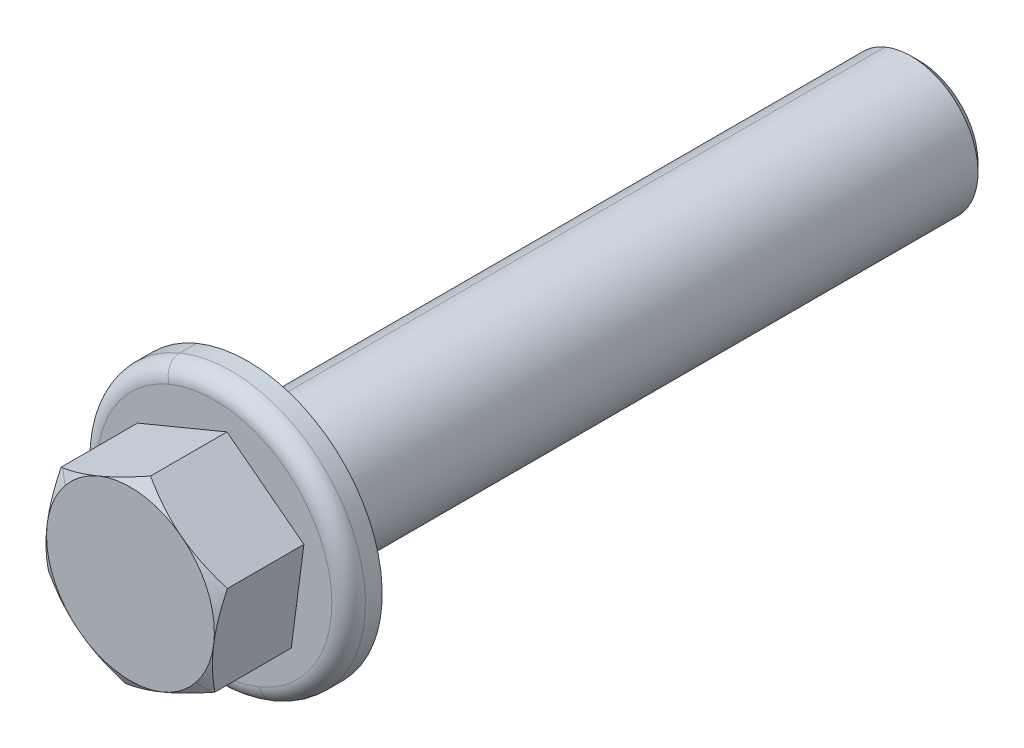
ISO-10303-21;
HEADER;
FILE_DESCRIPTION(('STEP AP214'),'2;1');
FILE_NAME('part.step','',(''),(''),'','','');
FILE_SCHEMA(('AUTOMOTIVE_DESIGN { 1 0 10303 214 1 1 1 1 }'));
ENDSEC;
DATA;
#1=APPLICATION_CONTEXT('core data for automotive mechanical design processes');
#2=APPLICATION_PROTOCOL_DEFINITION('international standard','automotive_design',2000,#1);
#3=PRODUCT_CONTEXT('',#1,'mechanical');
#4=PRODUCT('Part','Part','',(#3));
#5=PRODUCT_RELATED_PRODUCT_CATEGORY('part','',(#4));
#6=PRODUCT_DEFINITION_FORMATION('','',#4);
#7=PRODUCT_DEFINITION_CONTEXT('part definition',#1,'design');
#8=PRODUCT_DEFINITION('design','',#6,#7);
#9=PRODUCT_DEFINITION_SHAPE('','',#8);
#10=(LENGTH_UNIT() NAMED_UNIT(*) SI_UNIT(.MILLI.,.METRE.));
#11=(NAMED_UNIT(*) PLANE_ANGLE_UNIT() SI_UNIT($,.RADIAN.));
#12=(NAMED_UNIT(*) SI_UNIT($,.STERADIAN.) SOLID_ANGLE_UNIT());
#13=UNCERTAINTY_MEASURE_WITH_UNIT(LENGTH_MEASURE(1.E-05),#10,'distance_accuracy_value','');
#14=(GEOMETRIC_REPRESENTATION_CONTEXT(3) GLOBAL_UNCERTAINTY_ASSIGNED_CONTEXT((#13)) GLOBAL_UNIT_ASSIGNED_CONTEXT((#10,
#11,#12)) REPRESENTATION_CONTEXT('',''));
#15=CARTESIAN_POINT('',(0.,0.,0.));
#16=DIRECTION('',(0.,0.,1.));
#17=DIRECTION('',(1.,0.,0.));
#18=AXIS2_PLACEMENT_3D('',#15,#16,#17);
#19=CARTESIAN_POINT('',(-55.,-122.,24.3));
#20=DIRECTION('',(0.,0.,1.));
#21=DIRECTION('',(0.923728021347068,0.383049008063238,0.));
#22=AXIS2_PLACEMENT_3D('',#19,#20,#21);
#23=TOROIDAL_SURFACE('',#22,4.25,0.25);
#24=CARTESIAN_POINT('',(-55.,-122.,24.55));
#25=DIRECTION('',(0.,0.,-1.));
#26=DIRECTION('',(-0.923728021347068,-0.383049008063239,0.));
#27=AXIS2_PLACEMENT_3D('',#24,#25,#26);
#28=CIRCLE('',#27,4.25);
#29=CARTESIAN_POINT('',(-53.3720417157312,-125.925844090725,24.55));
#30=VERTEX_POINT('',#29);
#31=CARTESIAN_POINT('',(-56.6279582842688,-118.074155909275,24.55));
#32=VERTEX_POINT('',#31);
#33=EDGE_CURVE('E11',#30,#32,#28,.T.);
#34=ORIENTED_EDGE('',*,*,#33,.T.);
#35=CARTESIAN_POINT('',(-56.6279582842688,-118.074155909275,24.3));
#36=DIRECTION('',(0.923728021347068,0.383049008063238,0.));
#37=DIRECTION('',(0.,0.,1.));
#38=AXIS2_PLACEMENT_3D('',#35,#36,#37);
#39=CIRCLE('',#38,0.25);
#40=CARTESIAN_POINT('',(-56.532196032253,-118.305087914612,24.3));
#41=VERTEX_POINT('',#40);
#42=EDGE_CURVE('E33',#32,#41,#39,.T.);
#43=ORIENTED_EDGE('',*,*,#42,.T.);
#44=CARTESIAN_POINT('',(-55.,-122.,24.3));
#45=DIRECTION('',(0.,0.,-1.));
#46=DIRECTION('',(-0.923728021347069,-0.383049008063237,0.));
#47=AXIS2_PLACEMENT_3D('',#44,#45,#46);
#48=CIRCLE('',#47,4.);
#49=CARTESIAN_POINT('',(-53.4678039677471,-125.694912085388,24.3));
#50=VERTEX_POINT('',#49);
#51=EDGE_CURVE('E461',#50,#41,#48,.T.);
#52=ORIENTED_EDGE('',*,*,#51,.F.);
#53=CARTESIAN_POINT('',(-53.3720417157312,-125.925844090725,24.3));
#54=DIRECTION('',(-0.923728021347068,-0.383049008063238,0.));
#55=DIRECTION('',(0.,0.,1.));
#56=AXIS2_PLACEMENT_3D('',#53,#54,#55);
#57=CIRCLE('',#56,0.25);
#58=EDGE_CURVE('E457',#30,#50,#57,.T.);
#59=ORIENTED_EDGE('',*,*,#58,.F.);
#60=EDGE_LOOP('',(#34,#43,#52,#59));
#61=FACE_BOUND('',#60,.T.);
#62=ADVANCED_FACE('F17',(#61),#23,.F.);
#63=CARTESIAN_POINT('',(-55.,-122.,24.3));
#64=DIRECTION('',(0.,0.,1.));
#65=DIRECTION('',(-0.383049008063239,0.923728021347068,0.));
#66=AXIS2_PLACEMENT_3D('',#63,#64,#65);
#67=TOROIDAL_SURFACE('',#66,4.25,0.25);
#68=CARTESIAN_POINT('',(-55.,-122.,24.55));
#69=DIRECTION('',(0.,0.,-1.));
#70=DIRECTION('',(-0.923728021347068,-0.383049008063239,0.));
#71=AXIS2_PLACEMENT_3D('',#68,#69,#70);
#72=CIRCLE('',#71,4.25);
#73=EDGE_CURVE('E454',#32,#30,#72,.T.);
#74=ORIENTED_EDGE('',*,*,#73,.T.);
#75=ORIENTED_EDGE('',*,*,#58,.T.);
#76=CARTESIAN_POINT('',(-55.,-122.,24.3));
#77=DIRECTION('',(0.,0.,-1.));
#78=DIRECTION('',(-0.923728021347069,-0.383049008063237,0.));
#79=AXIS2_PLACEMENT_3D('',#76,#77,#78);
#80=CIRCLE('',#79,4.);
#81=EDGE_CURVE('E465',#41,#50,#80,.T.);
#82=ORIENTED_EDGE('',*,*,#81,.F.);
#83=ORIENTED_EDGE('',*,*,#42,.F.);
#84=EDGE_LOOP('',(#74,#75,#82,#83));
#85=FACE_BOUND('',#84,.T.);
#86=ADVANCED_FACE('F311',(#85),#67,.F.);
#87=CARTESIAN_POINT('',(-55.,-122.,4.55));
#88=DIRECTION('',(0.,0.,1.));
#89=DIRECTION('',(0.923728021347069,0.383049008063237,0.));
#90=AXIS2_PLACEMENT_3D('',#87,#88,#89);
#91=CYLINDRICAL_SURFACE('',#90,4.);
#92=DIRECTION('',(0.,0.,-1.));
#93=VECTOR('',#92,1.);
#94=CARTESIAN_POINT('',(-53.4678039677471,-125.694912085388,4.55));
#95=LINE('',#94,#93);
#96=CARTESIAN_POINT('',(-53.4678039677471,-125.694912085388,-14.95));
#97=VERTEX_POINT('',#96);
#98=EDGE_CURVE('E468',#50,#97,#95,.T.);
#99=ORIENTED_EDGE('',*,*,#98,.F.);
#100=ORIENTED_EDGE('',*,*,#51,.T.);
#101=DIRECTION('',(0.,0.,-1.));
#102=VECTOR('',#101,1.);
#103=CARTESIAN_POINT('',(-56.532196032253,-118.305087914612,4.55));
#104=LINE('',#103,#102);
#105=CARTESIAN_POINT('',(-56.532196032253,-118.305087914612,-14.95));
#106=VERTEX_POINT('',#105);
#107=EDGE_CURVE('E472',#41,#106,#104,.T.);
#108=ORIENTED_EDGE('',*,*,#107,.T.);
#109=CARTESIAN_POINT('',(-55.,-122.,-14.95));
#110=DIRECTION('',(0.,0.,1.));
#111=DIRECTION('',(-0.923728021347069,-0.383049008063237,0.));
#112=AXIS2_PLACEMENT_3D('',#109,#110,#111);
#113=CIRCLE('',#112,4.);
#114=EDGE_CURVE('E467',#106,#97,#113,.T.);
#115=ORIENTED_EDGE('',*,*,#114,.T.);
#116=EDGE_LOOP('',(#99,#100,#108,#115));
#117=FACE_BOUND('',#116,.T.);
#118=ADVANCED_FACE('F317',(#117),#91,.T.);
#119=CARTESIAN_POINT('',(-55.,-122.,4.55));
#120=DIRECTION('',(0.,0.,1.));
#121=DIRECTION('',(0.923728021347069,0.383049008063237,0.));
#122=AXIS2_PLACEMENT_3D('',#119,#120,#121);
#123=CYLINDRICAL_SURFACE('',#122,4.);
#124=ORIENTED_EDGE('',*,*,#107,.F.);
#125=ORIENTED_EDGE('',*,*,#81,.T.);
#126=ORIENTED_EDGE('',*,*,#98,.T.);
#127=CARTESIAN_POINT('',(-55.,-122.,-14.95));
#128=DIRECTION('',(0.,0.,1.));
#129=DIRECTION('',(-0.923728021347069,-0.383049008063237,0.));
#130=AXIS2_PLACEMENT_3D('',#127,#128,#129);
#131=CIRCLE('',#130,4.);
#132=EDGE_CURVE('E471',#97,#106,#131,.T.);
#133=ORIENTED_EDGE('',*,*,#132,.T.);
#134=EDGE_LOOP('',(#124,#125,#126,#133));
#135=FACE_BOUND('',#134,.T.);
#136=ADVANCED_FACE('F322',(#135),#123,.T.);
#137=CARTESIAN_POINT('',(-55.,-122.,-18.95));
#138=DIRECTION('',(0.,0.,1.));
#139=DIRECTION('',(-0.114958388351689,0.993370308066223,0.));
#140=AXIS2_PLACEMENT_3D('',#137,#138,#139);
#141=CONICAL_SURFACE('',#140,0.,0.785398163396999);
#142=DIRECTION('',(0.270856393052956,-0.653174413416782,-0.707106781186537));
#143=VECTOR('',#142,1.);
#144=CARTESIAN_POINT('',(-56.436432941916,-118.536019572316,-15.2));
#145=LINE('',#144,#143);
#146=CARTESIAN_POINT('',(-56.340671286211,-118.766951824929,-15.45));
#147=VERTEX_POINT('',#146);
#148=EDGE_CURVE('E478',#106,#147,#145,.T.);
#149=ORIENTED_EDGE('',*,*,#148,.T.);
#150=CARTESIAN_POINT('',(-55.,-122.,-15.45));
#151=DIRECTION('',(0.,0.,1.));
#152=DIRECTION('',(0.993370308066189,0.114958388351984,0.));
#153=AXIS2_PLACEMENT_3D('',#150,#151,#152);
#154=CIRCLE('',#153,3.5);
#155=CARTESIAN_POINT('',(-53.6593284717787,-125.233048074715,-15.45));
#156=VERTEX_POINT('',#155);
#157=EDGE_CURVE('E481',#147,#156,#154,.T.);
#158=ORIENTED_EDGE('',*,*,#157,.T.);
#159=DIRECTION('',(-0.270856551128283,0.65317434786655,-0.707106781186547));
#160=VECTOR('',#159,1.);
#161=CARTESIAN_POINT('',(-53.5635662197629,-125.463980080051,-15.2));
#162=LINE('',#161,#160);
#163=EDGE_CURVE('E484',#97,#156,#162,.T.);
#164=ORIENTED_EDGE('',*,*,#163,.F.);
#165=ORIENTED_EDGE('',*,*,#114,.F.);
#166=EDGE_LOOP('',(#149,#158,#164,#165));
#167=FACE_BOUND('',#166,.T.);
#168=ADVANCED_FACE('F326',(#167),#141,.T.);
#169=CARTESIAN_POINT('',(-54.9999999999992,-122.,-18.95));
#170=DIRECTION('',(-2.07112037355488E-13,-2.99341000002082E-13,1.));
#171=DIRECTION('',(0.383049008063238,-0.923728021347068,-1.97175609173E-13));
#172=AXIS2_PLACEMENT_3D('',#169,#170,#171);
#173=CONICAL_SURFACE('',#172,0.,0.785398163396999);
#174=ORIENTED_EDGE('',*,*,#163,.T.);
#175=CARTESIAN_POINT('',(-55.,-122.,-15.4499999999993));
#176=DIRECTION('',(-2.8263995886347E-13,-1.17204364682804E-13,1.));
#177=DIRECTION('',(0.923728021347068,0.383049008063237,3.05977465587E-13));
#178=AXIS2_PLACEMENT_3D('',#175,#176,#177);
#179=CIRCLE('',#178,3.5);
#180=EDGE_CURVE('E352',#156,#147,#179,.T.);
#181=ORIENTED_EDGE('',*,*,#180,.T.);
#182=ORIENTED_EDGE('',*,*,#148,.F.);
#183=ORIENTED_EDGE('',*,*,#132,.F.);
#184=EDGE_LOOP('',(#174,#181,#182,#183));
#185=FACE_BOUND('',#184,.T.);
#186=ADVANCED_FACE('F330',(#185),#173,.T.);
#187=CARTESIAN_POINT('',(-55.,-122.,-15.45));
#188=DIRECTION('',(0.,0.,1.));
#189=DIRECTION('',(-0.383049008063238,0.923728021347068,0.));
#190=AXIS2_PLACEMENT_3D('',#187,#188,#189);
#191=PLANE('',#190);
#192=ORIENTED_EDGE('',*,*,#180,.F.);
#193=ORIENTED_EDGE('',*,*,#157,.F.);
#194=EDGE_LOOP('',(#192,#193));
#195=FACE_BOUND('',#194,.T.);
#196=ADVANCED_FACE('F334',(#195),#191,.F.);
#197=CARTESIAN_POINT('',(-55.,-122.,31.55));
#198=DIRECTION('',(0.,0.,1.));
#199=DIRECTION('',(0.923728021347068,0.383049008063238,0.));
#200=AXIS2_PLACEMENT_3D('',#197,#198,#199);
#201=PLANE('',#200);
#202=CARTESIAN_POINT('',(-55.,-122.,31.55));
#203=DIRECTION('',(0.,0.,1.));
#204=DIRECTION('',(-0.923728021347068,-0.383049008063238,0.));
#205=AXIS2_PLACEMENT_3D('',#202,#203,#204);
#206=CIRCLE('',#205,5.);
#207=CARTESIAN_POINT('',(-50.0425178164705,-122.650669193983,31.5499999999994));
#208=VERTEX_POINT('',#207);
#209=CARTESIAN_POINT('',(-51.9577628567875,-118.032029087245,31.5499999999992));
#210=VERTEX_POINT('',#209);
#211=EDGE_CURVE('E347',#208,#210,#206,.T.);
#212=ORIENTED_EDGE('',*,*,#211,.T.);
#213=CARTESIAN_POINT('',(-55.,-122.,31.55));
#214=DIRECTION('',(0.,0.,1.));
#215=DIRECTION('',(-0.923728021347068,-0.383049008063238,0.));
#216=AXIS2_PLACEMENT_3D('',#213,#214,#215);
#217=CIRCLE('',#216,5.);
#218=CARTESIAN_POINT('',(-56.9152450403164,-117.381359893265,31.55));
#219=VERTEX_POINT('',#218);
#220=EDGE_CURVE('E353',#210,#219,#217,.T.);
#221=ORIENTED_EDGE('',*,*,#220,.T.);
#222=CARTESIAN_POINT('',(-55.,-122.,31.55));
#223=DIRECTION('',(0.,0.,1.));
#224=DIRECTION('',(-0.923728021347068,-0.383049008063238,0.));
#225=AXIS2_PLACEMENT_3D('',#222,#223,#224);
#226=CIRCLE('',#225,5.);
#227=CARTESIAN_POINT('',(-58.8950796699174,-118.864979367695,31.55));
#228=VERTEX_POINT('',#227);
#229=EDGE_CURVE('E368',#219,#228,#226,.T.);
#230=ORIENTED_EDGE('',*,*,#229,.T.);
#231=CARTESIAN_POINT('',(-55.,-122.,31.55));
#232=DIRECTION('',(0.,0.,1.));
#233=DIRECTION('',(-0.923728021347068,-0.383049008063238,0.));
#234=AXIS2_PLACEMENT_3D('',#231,#232,#233);
#235=CIRCLE('',#234,5.);
#236=CARTESIAN_POINT('',(-59.9574821835296,-121.349330806017,31.5499999999994));
#237=VERTEX_POINT('',#236);
#238=EDGE_CURVE('E372',#228,#237,#235,.T.);
#239=ORIENTED_EDGE('',*,*,#238,.T.);
#240=CARTESIAN_POINT('',(-55.,-122.,31.55));
#241=DIRECTION('',(0.,0.,1.));
#242=DIRECTION('',(-0.923728021347068,-0.383049008063238,0.));
#243=AXIS2_PLACEMENT_3D('',#240,#241,#242);
#244=CIRCLE('',#243,5.);
#245=CARTESIAN_POINT('',(-58.0422371432125,-125.967970912755,31.5499999999992));
#246=VERTEX_POINT('',#245);
#247=EDGE_CURVE('E172',#237,#246,#244,.T.);
#248=ORIENTED_EDGE('',*,*,#247,.T.);
#249=CARTESIAN_POINT('',(-55.,-122.,31.55));
#250=DIRECTION('',(0.,0.,1.));
#251=DIRECTION('',(-0.923728021347068,-0.383049008063238,0.));
#252=AXIS2_PLACEMENT_3D('',#249,#250,#251);
#253=CIRCLE('',#252,5.);
#254=CARTESIAN_POINT('',(-53.0847549596836,-126.618640106735,31.55));
#255=VERTEX_POINT('',#254);
#256=EDGE_CURVE('E147',#246,#255,#253,.T.);
#257=ORIENTED_EDGE('',*,*,#256,.T.);
#258=CARTESIAN_POINT('',(-55.,-122.,31.55));
#259=DIRECTION('',(0.,0.,1.));
#260=DIRECTION('',(-0.923728021347068,-0.383049008063238,0.));
#261=AXIS2_PLACEMENT_3D('',#258,#259,#260);
#262=CIRCLE('',#261,5.);
#263=CARTESIAN_POINT('',(-51.1049203300826,-125.135020632304,31.55));
#264=VERTEX_POINT('',#263);
#265=EDGE_CURVE('E160',#255,#264,#262,.T.);
#266=ORIENTED_EDGE('',*,*,#265,.T.);
#267=CARTESIAN_POINT('',(-55.,-122.,31.55));
#268=DIRECTION('',(0.,0.,1.));
#269=DIRECTION('',(-0.923728021347068,-0.383049008063238,0.));
#270=AXIS2_PLACEMENT_3D('',#267,#268,#269);
#271=CIRCLE('',#270,5.);
#272=EDGE_CURVE('E166',#264,#208,#271,.T.);
#273=ORIENTED_EDGE('',*,*,#272,.T.);
#274=EDGE_LOOP('',(#212,#221,#230,#239,#248,#257,#266,#273));
#275=FACE_BOUND('',#274,.T.);
#276=ADVANCED_FACE('F169',(#275),#201,.T.);
#277=CARTESIAN_POINT('',(-55.,-122.,31.55));
#278=DIRECTION('',(0.,0.,-1.));
#279=DIRECTION('',(0.779015933983816,-0.62700412646116,0.));
#280=AXIS2_PLACEMENT_3D('',#277,#278,#279);
#281=CONICAL_SURFACE('',#280,5.,1.0471975512);
#282=ORIENTED_EDGE('',*,*,#211,.F.);
#283=CARTESIAN_POINT('',(-49.6668537821693,-119.788465520815,31.1034180126158));
#284=CARTESIAN_POINT('',(-49.6974326745003,-120.021447680298,31.1712680083952));
#285=CARTESIAN_POINT('',(-49.7282564535898,-120.256295644637,31.2334304503108));
#286=CARTESIAN_POINT('',(-49.7901757203339,-120.728061734902,31.3430527974049));
#287=CARTESIAN_POINT('',(-49.8212690481887,-120.964963405202,31.3905854034299));
#288=CARTESIAN_POINT('',(-49.8682024855242,-121.322551687472,31.4489473736349));
#289=CARTESIAN_POINT('',(-49.8839062516109,-121.442199492084,31.4662522919643));
#290=CARTESIAN_POINT('',(-49.9153889641135,-121.682067904119,31.4962074663217));
#291=CARTESIAN_POINT('',(-49.9311679085397,-121.802288496382,31.5088578448605));
#292=CARTESIAN_POINT('',(-49.9628593420842,-122.043747164812,31.5292816727015));
#293=CARTESIAN_POINT('',(-49.9787721039597,-122.16498731913,31.5370303207411));
#294=CARTESIAN_POINT('',(-50.0106289229595,-122.407706067883,31.5474002095299));
#295=CARTESIAN_POINT('',(-50.0265729856561,-122.529184704773,31.5500204348124));
#296=CARTESIAN_POINT('',(-50.0425178164693,-122.650669193983,31.5499999999987));
#297=B_SPLINE_CURVE_WITH_KNOTS('',3,(#283,#284,#285,#286,#287,#288,#289,#290,#291,#292,#293,
#294,#295,#296),.UNSPECIFIED.,.F.,.F.,(4,2,2,2,2,2,4),(0.,0.734036658391774,1.46436443241734,
1.83000749078412,2.1956409244591,2.56310985866783,2.93065154716874),.UNSPECIFIED.);
#298=CARTESIAN_POINT('',(-49.6668537821689,-119.788465520817,31.1034180126158));
#299=VERTEX_POINT('',#298);
#300=EDGE_CURVE('E218',#299,#208,#297,.T.);
#301=ORIENTED_EDGE('',*,*,#300,.F.);
#302=CARTESIAN_POINT('',(-51.9577628567866,-118.032029087244,31.5499999999983));
#303=CARTESIAN_POINT('',(-51.8605266183714,-118.106579960392,31.550020434812));
#304=CARTESIAN_POINT('',(-51.7632950641555,-118.181127242172,31.5474002095295));
#305=CARTESIAN_POINT('',(-51.5690228712607,-118.330075431086,31.5370303207407));
#306=CARTESIAN_POINT('',(-51.4719821986002,-118.404476364273,31.5292816727012));
#307=CARTESIAN_POINT('',(-51.2787185745486,-118.55265128502,31.5088578448602));
#308=CARTESIAN_POINT('',(-51.1824939598041,-118.626426547869,31.4962074663214));
#309=CARTESIAN_POINT('',(-50.9905031776673,-118.773625582694,31.4662522919641));
#310=CARTESIAN_POINT('',(-50.8947370224096,-118.847049345366,31.4489473736346));
#311=CARTESIAN_POINT('',(-50.6085232045357,-119.06648903552,31.3905854034297));
#312=CARTESIAN_POINT('',(-50.4189070037848,-119.21186748248,31.3430527974047));
#313=CARTESIAN_POINT('',(-50.0413052183432,-119.501374185597,31.2334304503107));
#314=CARTESIAN_POINT('',(-49.8533328047433,-119.645492343498,31.1712680083951));
#315=CARTESIAN_POINT('',(-49.6668537821684,-119.788465520818,31.1034180126157));
#316=B_SPLINE_CURVE_WITH_KNOTS('',3,(#302,#303,#304,#305,#306,#307,#308,#309,#310,#311,#312,
#313,#314,#315),.UNSPECIFIED.,.F.,.F.,(4,2,2,2,2,2,4),(0.,0.367541688500727,0.735010622709288,
1.10064405638412,1.46628711475075,2.19661488877598,2.9306515471674),.UNSPECIFIED.);
#317=EDGE_CURVE('E234',#210,#299,#316,.T.);
#318=ORIENTED_EDGE('',*,*,#317,.F.);
#319=EDGE_LOOP('',(#282,#301,#318));
#320=FACE_BOUND('',#319,.T.);
#321=ADVANCED_FACE('F248',(#320),#281,.T.);
#322=CARTESIAN_POINT('',(-55.,-122.,31.55));
#323=DIRECTION('',(0.,0.,-1.));
#324=DIRECTION('',(0.779015933983816,-0.62700412646116,0.));
#325=AXIS2_PLACEMENT_3D('',#322,#323,#324);
#326=CONICAL_SURFACE('',#325,5.,1.0471975512);
#327=ORIENTED_EDGE('',*,*,#220,.F.);
#328=CARTESIAN_POINT('',(-54.2486719314015,-116.275592653672,31.1034180126171));
#329=CARTESIAN_POINT('',(-54.0621929088268,-116.418565830991,31.1712680083963));
#330=CARTESIAN_POINT('',(-53.8742204952272,-116.562683988892,31.2334304503117));
#331=CARTESIAN_POINT('',(-53.4966187097862,-116.852190692008,31.3430527974054));
#332=CARTESIAN_POINT('',(-53.3070025090355,-116.997569138968,31.3905854034302));
#333=CARTESIAN_POINT('',(-53.0207886911621,-117.217008829122,31.4489473736349));
#334=CARTESIAN_POINT('',(-52.9250225359044,-117.290432591794,31.4662522919644));
#335=CARTESIAN_POINT('',(-52.7330317537679,-117.437631626619,31.4962074663216));
#336=CARTESIAN_POINT('',(-52.6368071390236,-117.511406889468,31.5088578448604));
#337=CARTESIAN_POINT('',(-52.4435435149722,-117.659581810214,31.5292816727013));
#338=CARTESIAN_POINT('',(-52.3465028423119,-117.733982743402,31.5370303207408));
#339=CARTESIAN_POINT('',(-52.1522306494174,-117.882930932316,31.5474002095296));
#340=CARTESIAN_POINT('',(-52.0549990952016,-117.957478214095,31.550020434812));
#341=CARTESIAN_POINT('',(-51.9577628567866,-118.032029087244,31.5499999999983));
#342=B_SPLINE_CURVE_WITH_KNOTS('',3,(#328,#329,#330,#331,#332,#333,#334,#335,#336,#337,#338,
#339,#340,#341),.UNSPECIFIED.,.F.,.F.,(4,2,2,2,2,2,4),(0.,0.734036658390352,1.46436443241451,
1.83000749078061,2.19564092445489,2.56310985866291,2.93065154716312),.UNSPECIFIED.);
#343=CARTESIAN_POINT('',(-54.2486719314005,-116.275592653672,31.1034180126172));
#344=VERTEX_POINT('',#343);
#345=EDGE_CURVE('E225',#344,#210,#342,.T.);
#346=ORIENTED_EDGE('',*,*,#345,.F.);
#347=CARTESIAN_POINT('',(-56.9152450403164,-117.381359893264,31.55));
#348=CARTESIAN_POINT('',(-56.8020639710881,-117.334426277203,31.5500204348136));
#349=CARTESIAN_POINT('',(-56.6888883541756,-117.287494922092,31.5474002095311));
#350=CARTESIAN_POINT('',(-56.4627593422811,-117.193724362253,31.5370303207422));
#351=CARTESIAN_POINT('',(-56.3498059077451,-117.146885141123,31.5292816727027));
#352=CARTESIAN_POINT('',(-56.1248508501492,-117.05360139344,31.5088578448617));
#353=CARTESIAN_POINT('',(-56.0128472909785,-117.007156064027,31.4962074663229));
#354=CARTESIAN_POINT('',(-55.7893737963392,-116.914486686816,31.4662522919656));
#355=CARTESIAN_POINT('',(-55.6779038749949,-116.868262644876,31.4489473736361));
#356=CARTESIAN_POINT('',(-55.3447566197857,-116.730114052761,31.3905854034312));
#357=CARTESIAN_POINT('',(-55.12404709118,-116.638590829421,31.3430527974062));
#358=CARTESIAN_POINT('',(-54.6845260389945,-116.456331442273,31.2334304503122));
#359=CARTESIAN_POINT('',(-54.4657298463053,-116.365601635835,31.1712680083966));
#360=CARTESIAN_POINT('',(-54.2486719313995,-116.275592653672,31.1034180126172));
#361=B_SPLINE_CURVE_WITH_KNOTS('',3,(#347,#348,#349,#350,#351,#352,#353,#354,#355,#356,#357,
#358,#359,#360),.UNSPECIFIED.,.F.,.F.,(4,2,2,2,2,2,4),(0.,0.367541688500719,0.735010622709274,
1.10064405638406,1.4662871147507,2.19661488877592,2.93065154716732),.UNSPECIFIED.);
#362=EDGE_CURVE('E256',#219,#344,#361,.T.);
#363=ORIENTED_EDGE('',*,*,#362,.F.);
#364=EDGE_LOOP('',(#327,#346,#363));
#365=FACE_BOUND('',#364,.T.);
#366=ADVANCED_FACE('F243',(#365),#326,.T.);
#367=CARTESIAN_POINT('',(-55.,-122.,31.55));
#368=DIRECTION('',(0.,0.,-1.));
#369=DIRECTION('',(0.779015933983816,-0.62700412646116,0.));
#370=AXIS2_PLACEMENT_3D('',#367,#368,#369);
#371=CONICAL_SURFACE('',#370,5.,1.0471975512);
#372=DIRECTION('',(0.674647588782705,-0.543001501793055,0.500000000000169));
#373=VECTOR('',#372,1.);
#374=CARTESIAN_POINT('',(-60.6330775845845,-117.466122403752,30.2619216436));
#375=LINE('',#374,#373);
#376=CARTESIAN_POINT('',(-59.43841963032,-118.427663027451,31.1473157175631));
#377=VERTEX_POINT('',#376);
#378=EDGE_CURVE('E359',#377,#228,#375,.T.);
#379=ORIENTED_EDGE('',*,*,#378,.T.);
#380=ORIENTED_EDGE('',*,*,#229,.F.);
#381=CARTESIAN_POINT('',(-59.4384196303248,-118.427663027445,31.1473157175507));
#382=CARTESIAN_POINT('',(-59.2326782851979,-118.342346769475,31.2089939702821));
#383=CARTESIAN_POINT('',(-59.0253775700468,-118.256383876207,31.2652901400361));
#384=CARTESIAN_POINT('',(-58.6090670926169,-118.083749386682,31.3643275190329));
#385=CARTESIAN_POINT('',(-58.4000698032923,-117.997082962677,31.4071306974176));
#386=CARTESIAN_POINT('',(-58.084787904736,-117.866342727768,31.4595623012599));
#387=CARTESIAN_POINT('',(-57.9793373710404,-117.822614789026,31.4750826376559));
#388=CARTESIAN_POINT('',(-57.7679795727719,-117.734969515631,31.5019229351793));
#389=CARTESIAN_POINT('',(-57.6620723168931,-117.691052184584,31.5132429759077));
#390=CARTESIAN_POINT('',(-57.4494398563871,-117.602878337741,31.5315033490442));
#391=CARTESIAN_POINT('',(-57.3427131359981,-117.558621193393,31.538423132808));
#392=CARTESIAN_POINT('',(-57.1290740247674,-117.470029911383,31.547679987982));
#393=CARTESIAN_POINT('',(-57.0221616072164,-117.425695762644,31.5500163340105));
#394=CARTESIAN_POINT('',(-56.9152450403164,-117.381359893264,31.55));
#395=B_SPLINE_CURVE_WITH_KNOTS('',3,(#381,#382,#383,#384,#385,#386,#387,#388,#389,#390,#391,
#392,#393,#394),.UNSPECIFIED.,.F.,.F.,(4,2,2,2,2,2,4),(0.,0.693572709724988,1.38391201165235,
1.72946469135561,2.07501082206921,2.42215898329274,2.76936208027043),.UNSPECIFIED.);
#396=EDGE_CURVE('E262',#377,#219,#395,.T.);
#397=ORIENTED_EDGE('',*,*,#396,.F.);
#398=EDGE_LOOP('',(#379,#380,#397));
#399=FACE_BOUND('',#398,.T.);
#400=ADVANCED_FACE('F247',(#399),#371,.T.);
#401=CARTESIAN_POINT('',(-55.,-122.,31.55));
#402=DIRECTION('',(0.,0.,-1.));
#403=DIRECTION('',(0.779015933983816,-0.62700412646116,0.));
#404=AXIS2_PLACEMENT_3D('',#401,#402,#403);
#405=CONICAL_SURFACE('',#404,5.,1.0471975512);
#406=ORIENTED_EDGE('',*,*,#238,.F.);
#407=ORIENTED_EDGE('',*,*,#378,.F.);
#408=CARTESIAN_POINT('',(-59.4384196303191,-118.427663027451,31.1473157175));
#409=CARTESIAN_POINT('',(-59.4855993726784,-118.447227393903,31.1331782382));
#410=CARTESIAN_POINT('',(-59.533382008559,-118.46704176659,31.1185548376));
#411=CARTESIAN_POINT('',(-59.5818181492316,-118.487127132856,31.1034180126));
#412=B_SPLINE_CURVE_WITH_KNOTS('',3,(#408,#409,#410,#411),.UNSPECIFIED.,.F.,.F.,(4,4),(0.,1.),.UNSPECIFIED.);
#413=CARTESIAN_POINT('',(-59.5818181492313,-118.487127132854,31.1034180126083));
#414=VERTEX_POINT('',#413);
#415=EDGE_CURVE('E362',#377,#414,#412,.T.);
#416=ORIENTED_EDGE('',*,*,#415,.T.);
#417=CARTESIAN_POINT('',(-59.9574821835307,-121.349330806017,31.5499999999987));
#418=CARTESIAN_POINT('',(-59.9415373527175,-121.227846316807,31.5500204348124));
#419=CARTESIAN_POINT('',(-59.9255932900209,-121.106367679917,31.5474002095299));
#420=CARTESIAN_POINT('',(-59.8937364710211,-120.863648931164,31.5370303207411));
#421=CARTESIAN_POINT('',(-59.8778237091456,-120.742408776846,31.5292816727016));
#422=CARTESIAN_POINT('',(-59.8461322756012,-120.500950108417,31.5088578448606));
#423=CARTESIAN_POINT('',(-59.830353331175,-120.380729516154,31.4962074663217));
#424=CARTESIAN_POINT('',(-59.7988706186724,-120.140861104119,31.4662522919645));
#425=CARTESIAN_POINT('',(-59.7831668525858,-120.021213299507,31.448947373635));
#426=CARTESIAN_POINT('',(-59.7362334152503,-119.663625017237,31.3905854034302));
#427=CARTESIAN_POINT('',(-59.7051400873955,-119.426723346938,31.3430527974052));
#428=CARTESIAN_POINT('',(-59.6432208206514,-118.954957256673,31.2334304503113));
#429=CARTESIAN_POINT('',(-59.612397041562,-118.720109292334,31.1712680083958));
#430=CARTESIAN_POINT('',(-59.581818149231,-118.487127132852,31.1034180126165));
#431=B_SPLINE_CURVE_WITH_KNOTS('',3,(#417,#418,#419,#420,#421,#422,#423,#424,#425,#426,#427,
#428,#429,#430),.UNSPECIFIED.,.F.,.F.,(4,2,2,2,2,2,4),(0.,0.367541688500605,0.735010622709011,
1.10064405638369,1.46628711475018,2.19661488877512,2.93065154716625),.UNSPECIFIED.);
#432=EDGE_CURVE('E287',#237,#414,#431,.T.);
#433=ORIENTED_EDGE('',*,*,#432,.F.);
#434=EDGE_LOOP('',(#406,#407,#416,#433));
#435=FACE_BOUND('',#434,.T.);
#436=ADVANCED_FACE('F297',(#435),#405,.T.);
#437=CARTESIAN_POINT('',(-55.,-122.,31.55));
#438=DIRECTION('',(0.,0.,-1.));
#439=DIRECTION('',(0.779015933983816,-0.62700412646116,0.));
#440=AXIS2_PLACEMENT_3D('',#437,#438,#439);
#441=CONICAL_SURFACE('',#440,5.,1.0471975512);
#442=ORIENTED_EDGE('',*,*,#247,.F.);
#443=CARTESIAN_POINT('',(-60.3331462178307,-124.211534479184,31.1034180126158));
#444=CARTESIAN_POINT('',(-60.3025673254997,-123.978552319702,31.1712680083952));
#445=CARTESIAN_POINT('',(-60.2717435464102,-123.743704355363,31.2334304503108));
#446=CARTESIAN_POINT('',(-60.2098242796661,-123.271938265098,31.3430527974049));
#447=CARTESIAN_POINT('',(-60.1787309518113,-123.035036594798,31.3905854034299));
#448=CARTESIAN_POINT('',(-60.1317975144758,-122.677448312528,31.4489473736349));
#449=CARTESIAN_POINT('',(-60.1160937483892,-122.557800507916,31.4662522919643));
#450=CARTESIAN_POINT('',(-60.0846110358865,-122.317932095881,31.4962074663217));
#451=CARTESIAN_POINT('',(-60.0688320914603,-122.197711503618,31.5088578448605));
#452=CARTESIAN_POINT('',(-60.0371406579159,-121.956252835189,31.5292816727015));
#453=CARTESIAN_POINT('',(-60.0212278960404,-121.83501268087,31.5370303207411));
#454=CARTESIAN_POINT('',(-59.9893710770405,-121.592293932118,31.5474002095299));
#455=CARTESIAN_POINT('',(-59.9734270143439,-121.470815295227,31.5500204348124));
#456=CARTESIAN_POINT('',(-59.9574821835307,-121.349330806017,31.5499999999987));
#457=B_SPLINE_CURVE_WITH_KNOTS('',3,(#443,#444,#445,#446,#447,#448,#449,#450,#451,#452,#453,
#454,#455,#456),.UNSPECIFIED.,.F.,.F.,(4,2,2,2,2,2,4),(0.,0.734036658391659,1.46436443241713,
1.83000749078389,2.19564092445883,2.56310985866749,2.93065154716835),.UNSPECIFIED.);
#458=CARTESIAN_POINT('',(-60.3331462178312,-124.211534479183,31.1034180126158));
#459=VERTEX_POINT('',#458);
#460=EDGE_CURVE('E268',#459,#237,#457,.T.);
#461=ORIENTED_EDGE('',*,*,#460,.F.);
#462=CARTESIAN_POINT('',(-58.0422371432134,-125.967970912756,31.5499999999983));
#463=CARTESIAN_POINT('',(-58.1394733816286,-125.893420039608,31.550020434812));
#464=CARTESIAN_POINT('',(-58.2367049358445,-125.818872757828,31.5474002095295));
#465=CARTESIAN_POINT('',(-58.4309771287393,-125.669924568914,31.5370303207407));
#466=CARTESIAN_POINT('',(-58.5280178013998,-125.595523635727,31.5292816727012));
#467=CARTESIAN_POINT('',(-58.7212814254514,-125.44734871498,31.5088578448602));
#468=CARTESIAN_POINT('',(-58.8175060401959,-125.373573452131,31.4962074663214));
#469=CARTESIAN_POINT('',(-59.0094968223327,-125.226374417306,31.4662522919641));
#470=CARTESIAN_POINT('',(-59.1052629775904,-125.152950654634,31.4489473736346));
#471=CARTESIAN_POINT('',(-59.3914767954643,-124.93351096448,31.3905854034297));
#472=CARTESIAN_POINT('',(-59.5810929962152,-124.78813251752,31.3430527974047));
#473=CARTESIAN_POINT('',(-59.9586947816568,-124.498625814403,31.2334304503107));
#474=CARTESIAN_POINT('',(-60.1466671952567,-124.354507656502,31.1712680083951));
#475=CARTESIAN_POINT('',(-60.3331462178316,-124.211534479182,31.1034180126157));
#476=B_SPLINE_CURVE_WITH_KNOTS('',3,(#462,#463,#464,#465,#466,#467,#468,#469,#470,#471,#472,
#473,#474,#475),.UNSPECIFIED.,.F.,.F.,(4,2,2,2,2,2,4),(0.,0.367541688500744,0.735010622709288,
1.10064405638412,1.46628711475075,2.19661488877598,2.9306515471674),.UNSPECIFIED.);
#477=EDGE_CURVE('E188',#246,#459,#476,.T.);
#478=ORIENTED_EDGE('',*,*,#477,.F.);
#479=EDGE_LOOP('',(#442,#461,#478));
#480=FACE_BOUND('',#479,.T.);
#481=ADVANCED_FACE('F300',(#480),#441,.T.);
#482=CARTESIAN_POINT('',(-55.,-122.,31.55));
#483=DIRECTION('',(0.,0.,-1.));
#484=DIRECTION('',(0.779015933983816,-0.62700412646116,0.));
#485=AXIS2_PLACEMENT_3D('',#482,#483,#484);
#486=CONICAL_SURFACE('',#485,5.,1.0471975512);
#487=ORIENTED_EDGE('',*,*,#256,.F.);
#488=CARTESIAN_POINT('',(-55.7513280685985,-127.724407346328,31.1034180126171));
#489=CARTESIAN_POINT('',(-55.9378070911732,-127.581434169009,31.1712680083963));
#490=CARTESIAN_POINT('',(-56.1257795047728,-127.437316011108,31.2334304503117));
#491=CARTESIAN_POINT('',(-56.5033812902138,-127.147809307992,31.3430527974054));
#492=CARTESIAN_POINT('',(-56.6929974909645,-127.002430861032,31.3905854034302));
#493=CARTESIAN_POINT('',(-56.9792113088379,-126.782991170878,31.4489473736349));
#494=CARTESIAN_POINT('',(-57.0749774640956,-126.709567408206,31.4662522919644));
#495=CARTESIAN_POINT('',(-57.2669682462321,-126.562368373381,31.4962074663216));
#496=CARTESIAN_POINT('',(-57.3631928609764,-126.488593110532,31.5088578448604));
#497=CARTESIAN_POINT('',(-57.5564564850278,-126.340418189786,31.5292816727013));
#498=CARTESIAN_POINT('',(-57.6534971576881,-126.266017256598,31.5370303207408));
#499=CARTESIAN_POINT('',(-57.8477693505826,-126.117069067684,31.5474002095296));
#500=CARTESIAN_POINT('',(-57.9450009047984,-126.042521785905,31.550020434812));
#501=CARTESIAN_POINT('',(-58.0422371432134,-125.967970912756,31.5499999999983));
#502=B_SPLINE_CURVE_WITH_KNOTS('',3,(#488,#489,#490,#491,#492,#493,#494,#495,#496,#497,#498,
#499,#500,#501),.UNSPECIFIED.,.F.,.F.,(4,2,2,2,2,2,4),(0.,0.734036658390349,1.46436443241452,
1.83000749078063,2.19564092445491,2.56310985866293,2.93065154716311),.UNSPECIFIED.);
#503=CARTESIAN_POINT('',(-55.7513280685995,-127.724407346328,31.1034180126172));
#504=VERTEX_POINT('',#503);
#505=EDGE_CURVE('E150',#504,#246,#502,.T.);
#506=ORIENTED_EDGE('',*,*,#505,.F.);
#507=CARTESIAN_POINT('',(-53.0847549596836,-126.618640106736,31.55));
#508=CARTESIAN_POINT('',(-53.1979360289119,-126.665573722797,31.5500204348136));
#509=CARTESIAN_POINT('',(-53.3111116458244,-126.712505077908,31.5474002095311));
#510=CARTESIAN_POINT('',(-53.5372406577189,-126.806275637747,31.5370303207422));
#511=CARTESIAN_POINT('',(-53.6501940922549,-126.853114858877,31.5292816727027));
#512=CARTESIAN_POINT('',(-53.8751491498508,-126.94639860656,31.5088578448617));
#513=CARTESIAN_POINT('',(-53.9871527090215,-126.992843935973,31.4962074663229));
#514=CARTESIAN_POINT('',(-54.2106262036608,-127.085513313184,31.4662522919655));
#515=CARTESIAN_POINT('',(-54.3220961250051,-127.131737355124,31.4489473736361));
#516=CARTESIAN_POINT('',(-54.6552433802143,-127.269885947239,31.3905854034312));
#517=CARTESIAN_POINT('',(-54.8759529088199,-127.361409170579,31.3430527974062));
#518=CARTESIAN_POINT('',(-55.3154739610055,-127.543668557727,31.2334304503122));
#519=CARTESIAN_POINT('',(-55.5342701536947,-127.634398364164,31.1712680083966));
#520=CARTESIAN_POINT('',(-55.7513280686005,-127.724407346327,31.1034180126172));
#521=B_SPLINE_CURVE_WITH_KNOTS('',3,(#507,#508,#509,#510,#511,#512,#513,#514,#515,#516,#517,
#518,#519,#520),.UNSPECIFIED.,.F.,.F.,(4,2,2,2,2,2,4),(0.,0.367541688500721,0.735010622709256,
1.10064405638405,1.46628711475064,2.19661488877585,2.93065154716723),.UNSPECIFIED.);
#522=EDGE_CURVE('E21',#255,#504,#521,.T.);
#523=ORIENTED_EDGE('',*,*,#522,.F.);
#524=EDGE_LOOP('',(#487,#506,#523));
#525=FACE_BOUND('',#524,.T.);
#526=ADVANCED_FACE('F145',(#525),#486,.T.);
#527=CARTESIAN_POINT('',(-55.,-122.,31.55));
#528=DIRECTION('',(0.,0.,-1.));
#529=DIRECTION('',(0.779015933983816,-0.62700412646116,0.));
#530=AXIS2_PLACEMENT_3D('',#527,#528,#529);
#531=CONICAL_SURFACE('',#530,5.,1.0471975512);
#532=DIRECTION('',(-0.674647588782705,0.543001501793055,0.500000000000169));
#533=VECTOR('',#532,1.);
#534=CARTESIAN_POINT('',(-49.3669224154155,-126.533877596248,30.2619216436));
#535=LINE('',#534,#533);
#536=CARTESIAN_POINT('',(-50.56158036968,-125.572336972549,31.1473157175631));
#537=VERTEX_POINT('',#536);
#538=EDGE_CURVE('E163',#537,#264,#535,.T.);
#539=ORIENTED_EDGE('',*,*,#538,.T.);
#540=ORIENTED_EDGE('',*,*,#265,.F.);
#541=CARTESIAN_POINT('',(-50.5615803696752,-125.572336972555,31.1473157175507));
#542=CARTESIAN_POINT('',(-50.7673217148021,-125.657653230525,31.2089939702821));
#543=CARTESIAN_POINT('',(-50.9746224299532,-125.743616123793,31.2652901400361));
#544=CARTESIAN_POINT('',(-51.3909329073831,-125.916250613318,31.3643275190329));
#545=CARTESIAN_POINT('',(-51.5999301967077,-126.002917037323,31.4071306974176));
#546=CARTESIAN_POINT('',(-51.915212095264,-126.133657272232,31.4595623012599));
#547=CARTESIAN_POINT('',(-52.0206626289596,-126.177385210974,31.4750826376559));
#548=CARTESIAN_POINT('',(-52.2320204272281,-126.265030484369,31.5019229351793));
#549=CARTESIAN_POINT('',(-52.3379276831069,-126.308947815416,31.5132429759077));
#550=CARTESIAN_POINT('',(-52.5505601436129,-126.397121662259,31.5315033490442));
#551=CARTESIAN_POINT('',(-52.6572868640019,-126.441378806607,31.538423132808));
#552=CARTESIAN_POINT('',(-52.8709259752326,-126.529970088617,31.547679987982));
#553=CARTESIAN_POINT('',(-52.9778383927836,-126.574304237356,31.5500163340105));
#554=CARTESIAN_POINT('',(-53.0847549596836,-126.618640106736,31.55));
#555=B_SPLINE_CURVE_WITH_KNOTS('',3,(#541,#542,#543,#544,#545,#546,#547,#548,#549,#550,#551,
#552,#553,#554),.UNSPECIFIED.,.F.,.F.,(4,2,2,2,2,2,4),(0.,0.693572709724986,1.38391201165235,
1.7294646913556,2.07501082206922,2.42215898329274,2.76936208027045),.UNSPECIFIED.);
#556=EDGE_CURVE('E155',#537,#255,#555,.T.);
#557=ORIENTED_EDGE('',*,*,#556,.F.);
#558=EDGE_LOOP('',(#539,#540,#557));
#559=FACE_BOUND('',#558,.T.);
#560=ADVANCED_FACE('F161',(#559),#531,.T.);
#561=CARTESIAN_POINT('',(-55.,-122.,31.55));
#562=DIRECTION('',(0.,0.,-1.));
#563=DIRECTION('',(0.779015933983816,-0.62700412646116,0.));
#564=AXIS2_PLACEMENT_3D('',#561,#562,#563);
#565=CONICAL_SURFACE('',#564,5.,1.0471975512);
#566=ORIENTED_EDGE('',*,*,#272,.F.);
#567=ORIENTED_EDGE('',*,*,#538,.F.);
#568=CARTESIAN_POINT('',(-50.5615803696809,-125.572336972549,31.1473157175));
#569=CARTESIAN_POINT('',(-50.5144006273216,-125.552772606097,31.1331782382));
#570=CARTESIAN_POINT('',(-50.466617991441,-125.53295823341,31.1185548376));
#571=CARTESIAN_POINT('',(-50.4181818507684,-125.512872867144,31.1034180126));
#572=B_SPLINE_CURVE_WITH_KNOTS('',3,(#568,#569,#570,#571),.UNSPECIFIED.,.F.,.F.,(4,4),(0.,1.),.UNSPECIFIED.);
#573=CARTESIAN_POINT('',(-50.4181818507687,-125.512872867146,31.1034180126083));
#574=VERTEX_POINT('',#573);
#575=EDGE_CURVE('E178',#537,#574,#572,.T.);
#576=ORIENTED_EDGE('',*,*,#575,.T.);
#577=CARTESIAN_POINT('',(-50.0425178164693,-122.650669193983,31.5499999999987));
#578=CARTESIAN_POINT('',(-50.0584626472825,-122.772153683193,31.5500204348124));
#579=CARTESIAN_POINT('',(-50.0744067099791,-122.893632320084,31.5474002095299));
#580=CARTESIAN_POINT('',(-50.1062635289789,-123.136351068836,31.5370303207411));
#581=CARTESIAN_POINT('',(-50.1221762908544,-123.257591223154,31.5292816727016));
#582=CARTESIAN_POINT('',(-50.1538677243988,-123.499049891583,31.5088578448606));
#583=CARTESIAN_POINT('',(-50.169646668825,-123.619270483846,31.4962074663217));
#584=CARTESIAN_POINT('',(-50.2011293813276,-123.859138895881,31.4662522919645));
#585=CARTESIAN_POINT('',(-50.2168331474143,-123.978786700493,31.448947373635));
#586=CARTESIAN_POINT('',(-50.2637665847497,-124.336374982763,31.3905854034302));
#587=CARTESIAN_POINT('',(-50.2948599126045,-124.573276653063,31.3430527974052));
#588=CARTESIAN_POINT('',(-50.3567791793486,-125.045042743327,31.2334304503113));
#589=CARTESIAN_POINT('',(-50.387602958438,-125.279890707666,31.1712680083958));
#590=CARTESIAN_POINT('',(-50.418181850769,-125.512872867148,31.1034180126165));
#591=B_SPLINE_CURVE_WITH_KNOTS('',3,(#577,#578,#579,#580,#581,#582,#583,#584,#585,#586,#587,
#588,#589,#590),.UNSPECIFIED.,.F.,.F.,(4,2,2,2,2,2,4),(0.,0.367541688500567,0.735010622708945,
1.10064405638359,1.46628711475007,2.19661488877497,2.93065154716605),.UNSPECIFIED.);
#592=EDGE_CURVE('E211',#208,#574,#591,.T.);
#593=ORIENTED_EDGE('',*,*,#592,.F.);
#594=EDGE_LOOP('',(#566,#567,#576,#593));
#595=FACE_BOUND('',#594,.T.);
#596=ADVANCED_FACE('F201',(#595),#565,.T.);
#597=CARTESIAN_POINT('',(-50.4181818507684,-125.512872867144,24.55));
#598=DIRECTION('',(0.991496436705686,-0.130133838796557,0.));
#599=DIRECTION('',(-0.130133838796557,-0.991496436705686,0.));
#600=AXIS2_PLACEMENT_3D('',#597,#598,#599);
#601=PLANE('',#600);
#602=DIRECTION('',(0.,0.,1.));
#603=VECTOR('',#602,1.);
#604=CARTESIAN_POINT('',(-49.6668537821692,-119.788465520817,28.8267090063));
#605=LINE('',#604,#603);
#606=CARTESIAN_POINT('',(-49.6668537821692,-119.788465520817,26.55));
#607=VERTEX_POINT('',#606);
#608=EDGE_CURVE('E358',#607,#299,#605,.T.);
#609=ORIENTED_EDGE('',*,*,#608,.T.);
#610=ORIENTED_EDGE('',*,*,#300,.T.);
#611=ORIENTED_EDGE('',*,*,#592,.T.);
#612=DIRECTION('',(0.,0.,1.));
#613=VECTOR('',#612,1.);
#614=CARTESIAN_POINT('',(-50.4181818507684,-125.512872867144,28.8267090063));
#615=LINE('',#614,#613);
#616=CARTESIAN_POINT('',(-50.4181818507684,-125.512872867144,26.55));
#617=VERTEX_POINT('',#616);
#618=EDGE_CURVE('E179',#617,#574,#615,.T.);
#619=ORIENTED_EDGE('',*,*,#618,.F.);
#620=DIRECTION('',(0.130133838796557,0.991496436705686,0.));
#621=VECTOR('',#620,1.);
#622=CARTESIAN_POINT('',(-50.0425178164735,-122.650669193983,26.55));
#623=LINE('',#622,#621);
#624=EDGE_CURVE('E219',#617,#607,#623,.T.);
#625=ORIENTED_EDGE('',*,*,#624,.T.);
#626=EDGE_LOOP('',(#609,#610,#611,#619,#625));
#627=FACE_BOUND('',#626,.T.);
#628=ADVANCED_FACE('F206',(#627),#601,.T.);
#629=CARTESIAN_POINT('',(-49.6668537821692,-119.788465520817,24.55));
#630=DIRECTION('',(0.608447428642302,0.793594182550862,0.));
#631=DIRECTION('',(0.793594182550862,-0.608447428642302,0.));
#632=AXIS2_PLACEMENT_3D('',#629,#630,#631);
#633=PLANE('',#632);
#634=DIRECTION('',(0.,0.,1.));
#635=VECTOR('',#634,1.);
#636=CARTESIAN_POINT('',(-54.2486719314008,-116.275592653673,28.8267090063));
#637=LINE('',#636,#635);
#638=CARTESIAN_POINT('',(-54.2486719314008,-116.275592653673,26.55));
#639=VERTEX_POINT('',#638);
#640=EDGE_CURVE('E233',#639,#344,#637,.T.);
#641=ORIENTED_EDGE('',*,*,#640,.T.);
#642=ORIENTED_EDGE('',*,*,#345,.T.);
#643=ORIENTED_EDGE('',*,*,#317,.T.);
#644=ORIENTED_EDGE('',*,*,#608,.F.);
#645=DIRECTION('',(-0.793594182550862,0.608447428642302,0.));
#646=VECTOR('',#645,1.);
#647=CARTESIAN_POINT('',(-51.9577628567896,-118.032029087247,26.55));
#648=LINE('',#647,#646);
#649=EDGE_CURVE('E386',#607,#639,#648,.T.);
#650=ORIENTED_EDGE('',*,*,#649,.T.);
#651=EDGE_LOOP('',(#641,#642,#643,#644,#650));
#652=FACE_BOUND('',#651,.T.);
#653=ADVANCED_FACE('F240',(#652),#633,.T.);
#654=CARTESIAN_POINT('',(-54.2486719314008,-116.275592653673,24.55));
#655=DIRECTION('',(-0.383049008063238,0.923728021347068,0.));
#656=DIRECTION('',(0.923728021347068,0.383049008063238,0.));
#657=AXIS2_PLACEMENT_3D('',#654,#655,#656);
#658=PLANE('',#657);
#659=DIRECTION('',(0.,0.,1.));
#660=VECTOR('',#659,1.);
#661=CARTESIAN_POINT('',(-59.5818181492316,-118.487127132856,28.8267090063));
#662=LINE('',#661,#660);
#663=CARTESIAN_POINT('',(-59.5818181492316,-118.487127132856,26.55));
#664=VERTEX_POINT('',#663);
#665=EDGE_CURVE('E383',#664,#414,#662,.T.);
#666=ORIENTED_EDGE('',*,*,#665,.T.);
#667=ORIENTED_EDGE('',*,*,#415,.F.);
#668=ORIENTED_EDGE('',*,*,#396,.T.);
#669=ORIENTED_EDGE('',*,*,#362,.T.);
#670=ORIENTED_EDGE('',*,*,#640,.F.);
#671=DIRECTION('',(-0.923728021347068,-0.383049008063238,0.));
#672=VECTOR('',#671,1.);
#673=CARTESIAN_POINT('',(-56.9152450403189,-117.381359893266,26.55));
#674=LINE('',#673,#672);
#675=EDGE_CURVE('E263',#639,#664,#674,.T.);
#676=ORIENTED_EDGE('',*,*,#675,.T.);
#677=EDGE_LOOP('',(#666,#667,#668,#669,#670,#676));
#678=FACE_BOUND('',#677,.T.);
#679=ADVANCED_FACE('F275',(#678),#658,.T.);
#680=CARTESIAN_POINT('',(-59.5818181492316,-118.487127132856,24.55));
#681=DIRECTION('',(-0.991496436705686,0.130133838796557,0.));
#682=DIRECTION('',(0.130133838796557,0.991496436705686,0.));
#683=AXIS2_PLACEMENT_3D('',#680,#681,#682);
#684=PLANE('',#683);
#685=DIRECTION('',(0.,0.,1.));
#686=VECTOR('',#685,1.);
#687=CARTESIAN_POINT('',(-60.3331462178308,-124.211534479183,28.8267090063));
#688=LINE('',#687,#686);
#689=CARTESIAN_POINT('',(-60.3331462178308,-124.211534479183,26.55));
#690=VERTEX_POINT('',#689);
#691=EDGE_CURVE('E387',#690,#459,#688,.T.);
#692=ORIENTED_EDGE('',*,*,#691,.T.);
#693=ORIENTED_EDGE('',*,*,#460,.T.);
#694=ORIENTED_EDGE('',*,*,#432,.T.);
#695=ORIENTED_EDGE('',*,*,#665,.F.);
#696=DIRECTION('',(-0.130133838796557,-0.991496436705686,0.));
#697=VECTOR('',#696,1.);
#698=CARTESIAN_POINT('',(-59.9574821835266,-121.349330806017,26.55));
#699=LINE('',#698,#697);
#700=EDGE_CURVE('E292',#664,#690,#699,.T.);
#701=ORIENTED_EDGE('',*,*,#700,.T.);
#702=EDGE_LOOP('',(#692,#693,#694,#695,#701));
#703=FACE_BOUND('',#702,.T.);
#704=ADVANCED_FACE('F278',(#703),#684,.T.);
#705=CARTESIAN_POINT('',(-60.3331462178308,-124.211534479183,24.55));
#706=DIRECTION('',(-0.608447428642302,-0.793594182550862,0.));
#707=DIRECTION('',(-0.793594182550862,0.608447428642302,0.));
#708=AXIS2_PLACEMENT_3D('',#705,#706,#707);
#709=PLANE('',#708);
#710=DIRECTION('',(0.,0.,1.));
#711=VECTOR('',#710,1.);
#712=CARTESIAN_POINT('',(-55.7513280685992,-127.724407346327,28.8267090063));
#713=LINE('',#712,#711);
#714=CARTESIAN_POINT('',(-55.7513280685992,-127.724407346327,26.55));
#715=VERTEX_POINT('',#714);
#716=EDGE_CURVE('E390',#715,#504,#713,.T.);
#717=ORIENTED_EDGE('',*,*,#716,.T.);
#718=ORIENTED_EDGE('',*,*,#505,.T.);
#719=ORIENTED_EDGE('',*,*,#477,.T.);
#720=ORIENTED_EDGE('',*,*,#691,.F.);
#721=DIRECTION('',(0.793594182550862,-0.608447428642302,0.));
#722=VECTOR('',#721,1.);
#723=CARTESIAN_POINT('',(-58.0422371432104,-125.967970912753,26.55));
#724=LINE('',#723,#722);
#725=EDGE_CURVE('E180',#690,#715,#724,.T.);
#726=ORIENTED_EDGE('',*,*,#725,.T.);
#727=EDGE_LOOP('',(#717,#718,#719,#720,#726));
#728=FACE_BOUND('',#727,.T.);
#729=ADVANCED_FACE('F283',(#728),#709,.T.);
#730=CARTESIAN_POINT('',(-55.7513280685992,-127.724407346327,24.55));
#731=DIRECTION('',(0.383049008063238,-0.923728021347068,0.));
#732=DIRECTION('',(-0.923728021347068,-0.383049008063238,0.));
#733=AXIS2_PLACEMENT_3D('',#730,#731,#732);
#734=PLANE('',#733);
#735=ORIENTED_EDGE('',*,*,#618,.T.);
#736=ORIENTED_EDGE('',*,*,#575,.F.);
#737=ORIENTED_EDGE('',*,*,#556,.T.);
#738=ORIENTED_EDGE('',*,*,#522,.T.);
#739=ORIENTED_EDGE('',*,*,#716,.F.);
#740=DIRECTION('',(0.923728021347068,0.383049008063238,0.));
#741=VECTOR('',#740,1.);
#742=CARTESIAN_POINT('',(-53.0847549596811,-126.618640106734,26.55));
#743=LINE('',#742,#741);
#744=EDGE_CURVE('E156',#715,#617,#743,.T.);
#745=ORIENTED_EDGE('',*,*,#744,.T.);
#746=EDGE_LOOP('',(#735,#736,#737,#738,#739,#745));
#747=FACE_BOUND('',#746,.T.);
#748=ADVANCED_FACE('F176',(#747),#734,.T.);
#749=CARTESIAN_POINT('',(-55.,-122.,24.55));
#750=DIRECTION('',(0.,0.,1.));
#751=DIRECTION('',(-0.383049008063238,0.923728021347068,0.));
#752=AXIS2_PLACEMENT_3D('',#749,#750,#751);
#753=PLANE('',#752);
#754=CARTESIAN_POINT('',(-55.,-122.,24.55));
#755=DIRECTION('',(0.,0.,-1.));
#756=DIRECTION('',(-0.923728021347068,-0.383049008063237,0.));
#757=AXIS2_PLACEMENT_3D('',#754,#755,#756);
#758=CIRCLE('',#757,8.);
#759=CARTESIAN_POINT('',(-51.9356079354941,-129.389824170777,24.55));
#760=VERTEX_POINT('',#759);
#761=CARTESIAN_POINT('',(-58.0643920645059,-114.610175829223,24.55));
#762=VERTEX_POINT('',#761);
#763=EDGE_CURVE('E408',#760,#762,#758,.T.);
#764=ORIENTED_EDGE('',*,*,#763,.T.);
#765=CARTESIAN_POINT('',(-55.,-122.,24.55));
#766=DIRECTION('',(0.,0.,-1.));
#767=DIRECTION('',(-0.923728021347068,-0.383049008063237,0.));
#768=AXIS2_PLACEMENT_3D('',#765,#766,#767);
#769=CIRCLE('',#768,8.);
#770=EDGE_CURVE('E411',#762,#760,#769,.T.);
#771=ORIENTED_EDGE('',*,*,#770,.T.);
#772=EDGE_LOOP('',(#764,#771));
#773=FACE_BOUND('',#772,.T.);
#774=ORIENTED_EDGE('',*,*,#33,.F.);
#775=ORIENTED_EDGE('',*,*,#73,.F.);
#776=EDGE_LOOP('',(#774,#775));
#777=FACE_BOUND('',#776,.T.);
#778=ADVANCED_FACE('F448',(#773,#777),#753,.F.);
#779=CARTESIAN_POINT('',(-55.,-122.,26.55));
#780=DIRECTION('',(0.,0.,-1.));
#781=DIRECTION('',(0.383049008063238,-0.923728021347068,0.));
#782=AXIS2_PLACEMENT_3D('',#779,#780,#781);
#783=PLANE('',#782);
#784=CARTESIAN_POINT('',(-55.,-122.,26.55));
#785=DIRECTION('',(0.,0.,-1.));
#786=DIRECTION('',(0.923728021347068,0.383049008063239,0.));
#787=AXIS2_PLACEMENT_3D('',#784,#785,#786);
#788=CIRCLE('',#787,7.);
#789=CARTESIAN_POINT('',(-57.6813430564427,-115.53390385057,26.55));
#790=VERTEX_POINT('',#789);
#791=CARTESIAN_POINT('',(-52.3186569381759,-128.466096147198,26.55));
#792=VERTEX_POINT('',#791);
#793=EDGE_CURVE('E414',#790,#792,#788,.T.);
#794=ORIENTED_EDGE('',*,*,#793,.F.);
#795=CARTESIAN_POINT('',(-55.,-122.,26.55));
#796=DIRECTION('',(0.,0.,-1.));
#797=DIRECTION('',(0.923728021347068,0.383049008063239,0.));
#798=AXIS2_PLACEMENT_3D('',#795,#796,#797);
#799=CIRCLE('',#798,7.);
#800=EDGE_CURVE('E418',#792,#790,#799,.T.);
#801=ORIENTED_EDGE('',*,*,#800,.F.);
#802=EDGE_LOOP('',(#794,#801));
#803=FACE_BOUND('',#802,.T.);
#804=ORIENTED_EDGE('',*,*,#700,.F.);
#805=ORIENTED_EDGE('',*,*,#675,.F.);
#806=ORIENTED_EDGE('',*,*,#649,.F.);
#807=ORIENTED_EDGE('',*,*,#624,.F.);
#808=ORIENTED_EDGE('',*,*,#744,.F.);
#809=ORIENTED_EDGE('',*,*,#725,.F.);
#810=EDGE_LOOP('',(#804,#805,#806,#807,#808,#809));
#811=FACE_BOUND('',#810,.T.);
#812=ADVANCED_FACE('F451',(#803,#811),#783,.F.);
#813=CARTESIAN_POINT('',(-55.,-122.,25.55));
#814=DIRECTION('',(0.,0.,-1.));
#815=DIRECTION('',(-0.923728021347068,-0.383049008063237,0.));
#816=AXIS2_PLACEMENT_3D('',#813,#814,#815);
#817=CYLINDRICAL_SURFACE('',#816,8.);
#818=DIRECTION('',(0.,0.,-1.));
#819=VECTOR('',#818,1.);
#820=CARTESIAN_POINT('',(-58.0643920645059,-114.610175829223,25.55));
#821=LINE('',#820,#819);
#822=CARTESIAN_POINT('',(-58.0643920645059,-114.610175829223,25.55));
#823=VERTEX_POINT('',#822);
#824=EDGE_CURVE('E413',#823,#762,#821,.T.);
#825=ORIENTED_EDGE('',*,*,#824,.T.);
#826=ORIENTED_EDGE('',*,*,#763,.F.);
#827=DIRECTION('',(0.,0.,-1.));
#828=VECTOR('',#827,1.);
#829=CARTESIAN_POINT('',(-51.9356079354941,-129.389824170777,25.55));
#830=LINE('',#829,#828);
#831=CARTESIAN_POINT('',(-51.9356079354941,-129.389824170777,25.55));
#832=VERTEX_POINT('',#831);
#833=EDGE_CURVE('E425',#832,#760,#830,.T.);
#834=ORIENTED_EDGE('',*,*,#833,.F.);
#835=CARTESIAN_POINT('',(-55.,-122.,25.55));
#836=DIRECTION('',(0.,0.,-1.));
#837=DIRECTION('',(0.923728021347068,0.383049008063237,0.));
#838=AXIS2_PLACEMENT_3D('',#835,#836,#837);
#839=CIRCLE('',#838,8.);
#840=EDGE_CURVE('E424',#832,#823,#839,.T.);
#841=ORIENTED_EDGE('',*,*,#840,.T.);
#842=EDGE_LOOP('',(#825,#826,#834,#841));
#843=FACE_BOUND('',#842,.T.);
#844=ADVANCED_FACE('F444',(#843),#817,.T.);
#845=CARTESIAN_POINT('',(-55.,-122.,25.55));
#846=DIRECTION('',(0.,0.,-1.));
#847=DIRECTION('',(-0.923728021347068,-0.383049008063237,0.));
#848=AXIS2_PLACEMENT_3D('',#845,#846,#847);
#849=CYLINDRICAL_SURFACE('',#848,8.);
#850=ORIENTED_EDGE('',*,*,#833,.T.);
#851=ORIENTED_EDGE('',*,*,#770,.F.);
#852=ORIENTED_EDGE('',*,*,#824,.F.);
#853=CARTESIAN_POINT('',(-55.,-122.,25.55));
#854=DIRECTION('',(0.,0.,-1.));
#855=DIRECTION('',(0.923728021347068,0.383049008063237,0.));
#856=AXIS2_PLACEMENT_3D('',#853,#854,#855);
#857=CIRCLE('',#856,8.);
#858=EDGE_CURVE('E421',#823,#832,#857,.T.);
#859=ORIENTED_EDGE('',*,*,#858,.T.);
#860=EDGE_LOOP('',(#850,#851,#852,#859));
#861=FACE_BOUND('',#860,.T.);
#862=ADVANCED_FACE('F446',(#861),#849,.T.);
#863=CARTESIAN_POINT('',(-55.,-122.,25.55));
#864=DIRECTION('',(0.,0.,-1.));
#865=DIRECTION('',(-0.685304797594587,0.728256365845052,0.));
#866=AXIS2_PLACEMENT_3D('',#863,#864,#865);
#867=TOROIDAL_SURFACE('',#866,7.,1.);
#868=CARTESIAN_POINT('',(-52.3186568204793,-128.466096098392,25.55));
#869=DIRECTION('',(0.923728014055973,0.383049025645815,0.));
#870=DIRECTION('',(0.,0.,1.));
#871=AXIS2_PLACEMENT_3D('',#868,#869,#870);
#872=CIRCLE('',#871,1.);
#873=EDGE_CURVE('E417',#792,#832,#872,.T.);
#874=ORIENTED_EDGE('',*,*,#873,.F.);
#875=ORIENTED_EDGE('',*,*,#800,.T.);
#876=CARTESIAN_POINT('',(-57.6813430564427,-115.53390385057,25.55));
#877=DIRECTION('',(-0.923728021347068,-0.383049008063238,0.));
#878=DIRECTION('',(0.,0.,1.));
#879=AXIS2_PLACEMENT_3D('',#876,#877,#878);
#880=CIRCLE('',#879,1.);
#881=EDGE_CURVE('E416',#790,#823,#880,.T.);
#882=ORIENTED_EDGE('',*,*,#881,.T.);
#883=ORIENTED_EDGE('',*,*,#840,.F.);
#884=EDGE_LOOP('',(#874,#875,#882,#883));
#885=FACE_BOUND('',#884,.T.);
#886=ADVANCED_FACE('F437',(#885),#867,.T.);
#887=CARTESIAN_POINT('',(-55.,-122.,25.55));
#888=DIRECTION('',(0.,0.,-1.));
#889=DIRECTION('',(0.383049008063237,-0.923728021347069,0.));
#890=AXIS2_PLACEMENT_3D('',#887,#888,#889);
#891=TOROIDAL_SURFACE('',#890,7.,1.);
#892=ORIENTED_EDGE('',*,*,#881,.F.);
#893=ORIENTED_EDGE('',*,*,#793,.T.);
#894=ORIENTED_EDGE('',*,*,#873,.T.);
#895=ORIENTED_EDGE('',*,*,#858,.F.);
#896=EDGE_LOOP('',(#892,#893,#894,#895));
#897=FACE_BOUND('',#896,.T.);
#898=ADVANCED_FACE('F19',(#897),#891,.T.);
#899=CLOSED_SHELL('',(#62,#86,#118,#136,#168,#186,#196,#276,#321,#366,#400,#436,#481,#526,#560,
#596,#628,#653,#679,#704,#729,#748,#778,#812,#844,#862,#886,#898));
#900=MANIFOLD_SOLID_BREP('B1',#899);
#901=ADVANCED_BREP_SHAPE_REPRESENTATION('',(#18,#900),#14);
#902=SHAPE_DEFINITION_REPRESENTATION(#9,#901);
ENDSEC;
END-ISO-10303-21;
